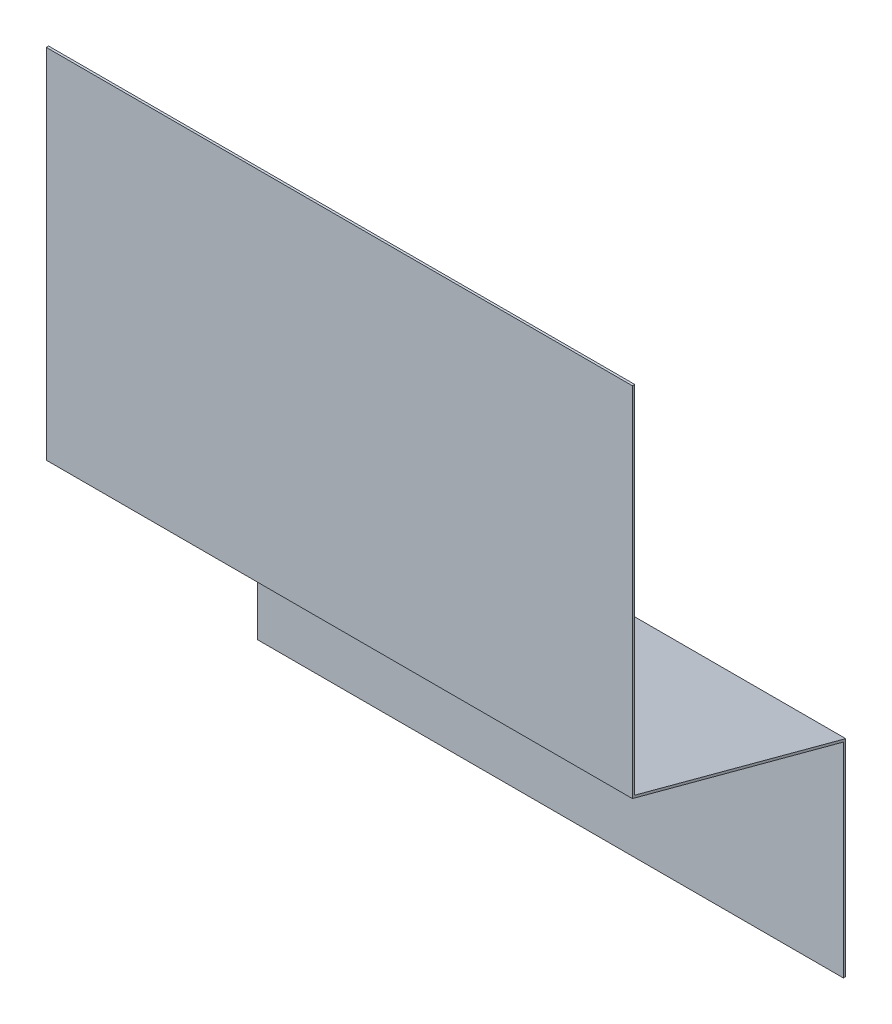
ISO-10303-21;
HEADER;
FILE_DESCRIPTION(('STEP AP214'),'2;1');
FILE_NAME('part.step','',(''),(''),'','','');
FILE_SCHEMA(('AUTOMOTIVE_DESIGN { 1 0 10303 214 1 1 1 1 }'));
ENDSEC;
DATA;
#1=APPLICATION_CONTEXT('core data for automotive mechanical design processes');
#2=APPLICATION_PROTOCOL_DEFINITION('international standard','automotive_design',2000,#1);
#3=PRODUCT_CONTEXT('',#1,'mechanical');
#4=PRODUCT('Part','Part','',(#3));
#5=PRODUCT_RELATED_PRODUCT_CATEGORY('part','',(#4));
#6=PRODUCT_DEFINITION_FORMATION('','',#4);
#7=PRODUCT_DEFINITION_CONTEXT('part definition',#1,'design');
#8=PRODUCT_DEFINITION('design','',#6,#7);
#9=PRODUCT_DEFINITION_SHAPE('','',#8);
#10=(LENGTH_UNIT() NAMED_UNIT(*) SI_UNIT(.MILLI.,.METRE.));
#11=(NAMED_UNIT(*) PLANE_ANGLE_UNIT() SI_UNIT($,.RADIAN.));
#12=(NAMED_UNIT(*) SI_UNIT($,.STERADIAN.) SOLID_ANGLE_UNIT());
#13=UNCERTAINTY_MEASURE_WITH_UNIT(LENGTH_MEASURE(1.E-05),#10,'distance_accuracy_value','');
#14=(GEOMETRIC_REPRESENTATION_CONTEXT(3) GLOBAL_UNCERTAINTY_ASSIGNED_CONTEXT((#13)) GLOBAL_UNIT_ASSIGNED_CONTEXT((#10,
#11,#12)) REPRESENTATION_CONTEXT('',''));
#15=CARTESIAN_POINT('',(0.,0.,0.));
#16=DIRECTION('',(0.,0.,1.));
#17=DIRECTION('',(1.,0.,0.));
#18=AXIS2_PLACEMENT_3D('',#15,#16,#17);
#19=CARTESIAN_POINT('',(397.256,178.017270416035,143.002));
#20=DIRECTION('',(0.,0.,1.));
#21=DIRECTION('',(0.,-1.,0.));
#22=AXIS2_PLACEMENT_3D('',#19,#20,#21);
#23=PLANE('',#22);
#24=DIRECTION('',(0.,1.,0.));
#25=VECTOR('',#24,1.);
#26=CARTESIAN_POINT('',(0.,178.017270416035,143.002));
#27=LINE('',#26,#25);
#28=CARTESIAN_POINT('',(0.,178.017270416035,143.002));
#29=VERTEX_POINT('',#28);
#30=CARTESIAN_POINT('',(0.,419.1,143.002));
#31=VERTEX_POINT('',#30);
#32=EDGE_CURVE('E132',#29,#31,#27,.T.);
#33=ORIENTED_EDGE('',*,*,#32,.T.);
#34=DIRECTION('',(-1.,0.,0.));
#35=VECTOR('',#34,1.);
#36=CARTESIAN_POINT('',(397.256,419.1,143.002));
#37=LINE('',#36,#35);
#38=CARTESIAN_POINT('',(397.256,419.1,143.002));
#39=VERTEX_POINT('',#38);
#40=EDGE_CURVE('E11',#39,#31,#37,.T.);
#41=ORIENTED_EDGE('',*,*,#40,.F.);
#42=DIRECTION('',(0.,1.,0.));
#43=VECTOR('',#42,1.);
#44=CARTESIAN_POINT('',(397.256,178.017270416035,143.002));
#45=LINE('',#44,#43);
#46=CARTESIAN_POINT('',(397.256,178.017270416035,143.002));
#47=VERTEX_POINT('',#46);
#48=EDGE_CURVE('E90',#47,#39,#45,.T.);
#49=ORIENTED_EDGE('',*,*,#48,.F.);
#50=DIRECTION('',(-1.,0.,0.));
#51=VECTOR('',#50,1.);
#52=CARTESIAN_POINT('',(397.256,178.017270416035,143.002));
#53=LINE('',#52,#51);
#54=EDGE_CURVE('E131',#47,#29,#53,.T.);
#55=ORIENTED_EDGE('',*,*,#54,.T.);
#56=EDGE_LOOP('',(#33,#41,#49,#55));
#57=FACE_BOUND('',#56,.T.);
#58=ADVANCED_FACE('F35',(#57),#23,.F.);
#59=CARTESIAN_POINT('',(397.256,419.1,144.5895));
#60=DIRECTION('',(0.,1.,0.));
#61=DIRECTION('',(0.,0.,1.));
#62=AXIS2_PLACEMENT_3D('',#59,#60,#61);
#63=PLANE('',#62);
#64=DIRECTION('',(0.,0.,-1.));
#65=VECTOR('',#64,1.);
#66=CARTESIAN_POINT('',(0.,419.1,144.5895));
#67=LINE('',#66,#65);
#68=CARTESIAN_POINT('',(0.,419.1,144.5895));
#69=VERTEX_POINT('',#68);
#70=EDGE_CURVE('E135',#69,#31,#67,.T.);
#71=ORIENTED_EDGE('',*,*,#70,.F.);
#72=DIRECTION('',(-1.,0.,0.));
#73=VECTOR('',#72,1.);
#74=CARTESIAN_POINT('',(397.256,419.1,144.5895));
#75=LINE('',#74,#73);
#76=CARTESIAN_POINT('',(397.256,419.1,144.5895));
#77=VERTEX_POINT('',#76);
#78=EDGE_CURVE('E43',#77,#69,#75,.T.);
#79=ORIENTED_EDGE('',*,*,#78,.F.);
#80=DIRECTION('',(0.,0.,-1.));
#81=VECTOR('',#80,1.);
#82=CARTESIAN_POINT('',(397.256,419.1,144.5895));
#83=LINE('',#82,#81);
#84=EDGE_CURVE('E174',#77,#39,#83,.T.);
#85=ORIENTED_EDGE('',*,*,#84,.T.);
#86=ORIENTED_EDGE('',*,*,#40,.T.);
#87=EDGE_LOOP('',(#71,#79,#85,#86));
#88=FACE_BOUND('',#87,.T.);
#89=ADVANCED_FACE('F165',(#88),#63,.T.);
#90=CARTESIAN_POINT('',(397.256,178.017270416035,144.5895));
#91=DIRECTION('',(0.,0.,1.));
#92=DIRECTION('',(0.,-1.,0.));
#93=AXIS2_PLACEMENT_3D('',#90,#91,#92);
#94=PLANE('',#93);
#95=DIRECTION('',(0.,1.,0.));
#96=VECTOR('',#95,1.);
#97=CARTESIAN_POINT('',(0.,178.017270416035,144.5895));
#98=LINE('',#97,#96);
#99=CARTESIAN_POINT('',(0.,176.799138822619,144.5895));
#100=VERTEX_POINT('',#99);
#101=EDGE_CURVE('E138',#100,#69,#98,.T.);
#102=ORIENTED_EDGE('',*,*,#101,.F.);
#103=DIRECTION('',(-1.,0.,0.));
#104=VECTOR('',#103,1.);
#105=CARTESIAN_POINT('',(397.256,176.799138822619,144.5895));
#106=LINE('',#105,#104);
#107=CARTESIAN_POINT('',(397.256,176.799138822619,144.5895));
#108=VERTEX_POINT('',#107);
#109=EDGE_CURVE('E155',#108,#100,#106,.T.);
#110=ORIENTED_EDGE('',*,*,#109,.F.);
#111=DIRECTION('',(0.,1.,0.));
#112=VECTOR('',#111,1.);
#113=CARTESIAN_POINT('',(397.256,178.017270416035,144.5895));
#114=LINE('',#113,#112);
#115=EDGE_CURVE('E162',#108,#77,#114,.T.);
#116=ORIENTED_EDGE('',*,*,#115,.T.);
#117=ORIENTED_EDGE('',*,*,#78,.T.);
#118=EDGE_LOOP('',(#102,#110,#116,#117));
#119=FACE_BOUND('',#118,.T.);
#120=ADVANCED_FACE('F160',(#119),#94,.T.);
#121=CARTESIAN_POINT('',(397.256,138.166592750766,0.410875234100253));
#122=DIRECTION('',(0.,-0.965925826289068,0.258819045102522));
#123=DIRECTION('',(0.,-0.258819045102522,-0.965925826289068));
#124=AXIS2_PLACEMENT_3D('',#121,#122,#123);
#125=PLANE('',#124);
#126=DIRECTION('',(0.,0.258819045102522,0.965925826289068));
#127=VECTOR('',#126,1.);
#128=CARTESIAN_POINT('',(0.,138.166592750766,0.410875234100253));
#129=LINE('',#128,#127);
#130=CARTESIAN_POINT('',(0.,138.481868406583,1.5875));
#131=VERTEX_POINT('',#130);
#132=EDGE_CURVE('E141',#131,#100,#129,.T.);
#133=ORIENTED_EDGE('',*,*,#132,.F.);
#134=DIRECTION('',(-1.,0.,0.));
#135=VECTOR('',#134,1.);
#136=CARTESIAN_POINT('',(397.256,138.481868406583,1.5875));
#137=LINE('',#136,#135);
#138=CARTESIAN_POINT('',(397.256,138.481868406583,1.5875));
#139=VERTEX_POINT('',#138);
#140=EDGE_CURVE('E153',#139,#131,#137,.T.);
#141=ORIENTED_EDGE('',*,*,#140,.F.);
#142=DIRECTION('',(0.,0.258819045102522,0.965925826289068));
#143=VECTOR('',#142,1.);
#144=CARTESIAN_POINT('',(397.256,138.166592750766,0.410875234100253));
#145=LINE('',#144,#143);
#146=EDGE_CURVE('E126',#139,#108,#145,.T.);
#147=ORIENTED_EDGE('',*,*,#146,.T.);
#148=ORIENTED_EDGE('',*,*,#109,.T.);
#149=EDGE_LOOP('',(#133,#141,#147,#148));
#150=FACE_BOUND('',#149,.T.);
#151=ADVANCED_FACE('F172',(#150),#125,.T.);
#152=CARTESIAN_POINT('',(397.256,0.,1.5875));
#153=DIRECTION('',(0.,0.,1.));
#154=DIRECTION('',(1.,0.,0.));
#155=AXIS2_PLACEMENT_3D('',#152,#153,#154);
#156=PLANE('',#155);
#157=DIRECTION('',(0.,1.,0.));
#158=VECTOR('',#157,1.);
#159=CARTESIAN_POINT('',(0.,0.,1.5875));
#160=LINE('',#159,#158);
#161=CARTESIAN_POINT('',(0.,0.,1.5875));
#162=VERTEX_POINT('',#161);
#163=EDGE_CURVE('E144',#162,#131,#160,.T.);
#164=ORIENTED_EDGE('',*,*,#163,.F.);
#165=DIRECTION('',(-1.,0.,0.));
#166=VECTOR('',#165,1.);
#167=CARTESIAN_POINT('',(397.256,0.,1.5875));
#168=LINE('',#167,#166);
#169=CARTESIAN_POINT('',(397.256,0.,1.5875));
#170=VERTEX_POINT('',#169);
#171=EDGE_CURVE('E114',#170,#162,#168,.T.);
#172=ORIENTED_EDGE('',*,*,#171,.F.);
#173=DIRECTION('',(0.,1.,0.));
#174=VECTOR('',#173,1.);
#175=CARTESIAN_POINT('',(397.256,0.,1.5875));
#176=LINE('',#175,#174);
#177=EDGE_CURVE('E124',#170,#139,#176,.T.);
#178=ORIENTED_EDGE('',*,*,#177,.T.);
#179=ORIENTED_EDGE('',*,*,#140,.T.);
#180=EDGE_LOOP('',(#164,#172,#178,#179));
#181=FACE_BOUND('',#180,.T.);
#182=ADVANCED_FACE('F179',(#181),#156,.T.);
#183=CARTESIAN_POINT('',(397.256,0.,0.));
#184=DIRECTION('',(0.,-1.,0.));
#185=DIRECTION('',(0.,0.,-1.));
#186=AXIS2_PLACEMENT_3D('',#183,#184,#185);
#187=PLANE('',#186);
#188=DIRECTION('',(0.,0.,1.));
#189=VECTOR('',#188,1.);
#190=CARTESIAN_POINT('',(0.,0.,0.));
#191=LINE('',#190,#189);
#192=CARTESIAN_POINT('',(0.,0.,0.));
#193=VERTEX_POINT('',#192);
#194=EDGE_CURVE('E113',#193,#162,#191,.T.);
#195=ORIENTED_EDGE('',*,*,#194,.F.);
#196=DIRECTION('',(-1.,0.,0.));
#197=VECTOR('',#196,1.);
#198=CARTESIAN_POINT('',(397.256,0.,0.));
#199=LINE('',#198,#197);
#200=CARTESIAN_POINT('',(397.256,0.,0.));
#201=VERTEX_POINT('',#200);
#202=EDGE_CURVE('E107',#201,#193,#199,.T.);
#203=ORIENTED_EDGE('',*,*,#202,.F.);
#204=DIRECTION('',(0.,0.,1.));
#205=VECTOR('',#204,1.);
#206=CARTESIAN_POINT('',(397.256,0.,0.));
#207=LINE('',#206,#205);
#208=EDGE_CURVE('E111',#201,#170,#207,.T.);
#209=ORIENTED_EDGE('',*,*,#208,.T.);
#210=ORIENTED_EDGE('',*,*,#171,.T.);
#211=EDGE_LOOP('',(#195,#203,#209,#210));
#212=FACE_BOUND('',#211,.T.);
#213=ADVANCED_FACE('F109',(#212),#187,.T.);
#214=CARTESIAN_POINT('',(397.256,0.,0.));
#215=DIRECTION('',(0.,0.,1.));
#216=DIRECTION('',(1.,0.,0.));
#217=AXIS2_PLACEMENT_3D('',#214,#215,#216);
#218=PLANE('',#217);
#219=DIRECTION('',(0.,1.,0.));
#220=VECTOR('',#219,1.);
#221=CARTESIAN_POINT('',(0.,0.,0.));
#222=LINE('',#221,#220);
#223=CARTESIAN_POINT('',(0.,139.7,0.));
#224=VERTEX_POINT('',#223);
#225=EDGE_CURVE('E78',#193,#224,#222,.T.);
#226=ORIENTED_EDGE('',*,*,#225,.T.);
#227=DIRECTION('',(-1.,0.,0.));
#228=VECTOR('',#227,1.);
#229=CARTESIAN_POINT('',(397.256,139.7,0.));
#230=LINE('',#229,#228);
#231=CARTESIAN_POINT('',(397.256,139.7,0.));
#232=VERTEX_POINT('',#231);
#233=EDGE_CURVE('E115',#232,#224,#230,.T.);
#234=ORIENTED_EDGE('',*,*,#233,.F.);
#235=DIRECTION('',(0.,1.,0.));
#236=VECTOR('',#235,1.);
#237=CARTESIAN_POINT('',(397.256,0.,0.));
#238=LINE('',#237,#236);
#239=EDGE_CURVE('E117',#201,#232,#238,.T.);
#240=ORIENTED_EDGE('',*,*,#239,.F.);
#241=ORIENTED_EDGE('',*,*,#202,.T.);
#242=EDGE_LOOP('',(#226,#234,#240,#241));
#243=FACE_BOUND('',#242,.T.);
#244=ADVANCED_FACE('F118',(#243),#218,.F.);
#245=CARTESIAN_POINT('',(397.256,139.7,0.));
#246=DIRECTION('',(0.,-0.965925826289068,0.258819045102522));
#247=DIRECTION('',(0.,-0.258819045102522,-0.965925826289068));
#248=AXIS2_PLACEMENT_3D('',#245,#246,#247);
#249=PLANE('',#248);
#250=DIRECTION('',(0.,0.258819045102522,0.965925826289068));
#251=VECTOR('',#250,1.);
#252=CARTESIAN_POINT('',(0.,139.7,0.));
#253=LINE('',#252,#251);
#254=EDGE_CURVE('E84',#224,#29,#253,.T.);
#255=ORIENTED_EDGE('',*,*,#254,.T.);
#256=ORIENTED_EDGE('',*,*,#54,.F.);
#257=DIRECTION('',(0.,0.258819045102522,0.965925826289068));
#258=VECTOR('',#257,1.);
#259=CARTESIAN_POINT('',(397.256,139.7,0.));
#260=LINE('',#259,#258);
#261=EDGE_CURVE('E51',#232,#47,#260,.T.);
#262=ORIENTED_EDGE('',*,*,#261,.F.);
#263=ORIENTED_EDGE('',*,*,#233,.T.);
#264=EDGE_LOOP('',(#255,#256,#262,#263));
#265=FACE_BOUND('',#264,.T.);
#266=ADVANCED_FACE('F181',(#265),#249,.F.);
#267=CARTESIAN_POINT('',(397.256,0.,0.));
#268=DIRECTION('',(-1.,0.,0.));
#269=DIRECTION('',(0.,0.,1.));
#270=AXIS2_PLACEMENT_3D('',#267,#268,#269);
#271=PLANE('',#270);
#272=ORIENTED_EDGE('',*,*,#48,.T.);
#273=ORIENTED_EDGE('',*,*,#84,.F.);
#274=ORIENTED_EDGE('',*,*,#115,.F.);
#275=ORIENTED_EDGE('',*,*,#146,.F.);
#276=ORIENTED_EDGE('',*,*,#177,.F.);
#277=ORIENTED_EDGE('',*,*,#208,.F.);
#278=ORIENTED_EDGE('',*,*,#239,.T.);
#279=ORIENTED_EDGE('',*,*,#261,.T.);
#280=EDGE_LOOP('',(#272,#273,#274,#275,#276,#277,#278,#279));
#281=FACE_BOUND('',#280,.T.);
#282=ADVANCED_FACE('F121',(#281),#271,.F.);
#283=CARTESIAN_POINT('',(0.,0.,0.));
#284=DIRECTION('',(-1.,0.,0.));
#285=DIRECTION('',(0.,0.,1.));
#286=AXIS2_PLACEMENT_3D('',#283,#284,#285);
#287=PLANE('',#286);
#288=ORIENTED_EDGE('',*,*,#32,.F.);
#289=ORIENTED_EDGE('',*,*,#254,.F.);
#290=ORIENTED_EDGE('',*,*,#225,.F.);
#291=ORIENTED_EDGE('',*,*,#194,.T.);
#292=ORIENTED_EDGE('',*,*,#163,.T.);
#293=ORIENTED_EDGE('',*,*,#132,.T.);
#294=ORIENTED_EDGE('',*,*,#101,.T.);
#295=ORIENTED_EDGE('',*,*,#70,.T.);
#296=EDGE_LOOP('',(#288,#289,#290,#291,#292,#293,#294,#295));
#297=FACE_BOUND('',#296,.T.);
#298=ADVANCED_FACE('F168',(#297),#287,.T.);
#299=CLOSED_SHELL('',(#58,#89,#120,#151,#182,#213,#244,#266,#282,#298));
#300=MANIFOLD_SOLID_BREP('B2',#299);
#301=ADVANCED_BREP_SHAPE_REPRESENTATION('',(#18,#300),#14);
#302=SHAPE_DEFINITION_REPRESENTATION(#9,#301);
ENDSEC;
END-ISO-10303-21;
